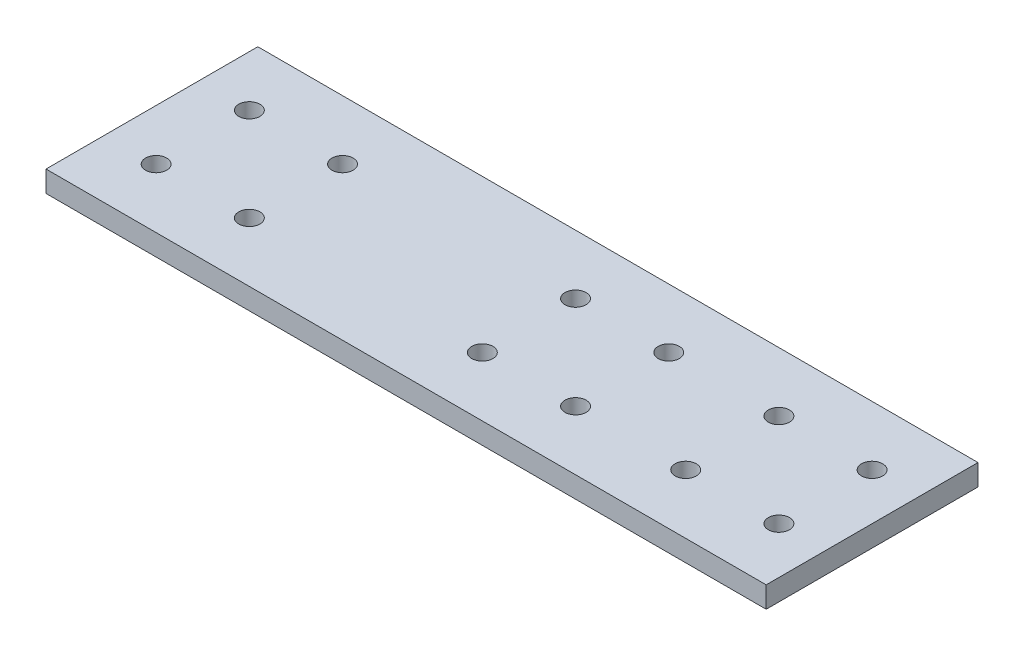
ISO-10303-21;
HEADER;
FILE_DESCRIPTION(('STEP AP214'),'2;1');
FILE_NAME('part.step','',(''),(''),'','','');
FILE_SCHEMA(('AUTOMOTIVE_DESIGN { 1 0 10303 214 1 1 1 1 }'));
ENDSEC;
DATA;
#1=APPLICATION_CONTEXT('core data for automotive mechanical design processes');
#2=APPLICATION_PROTOCOL_DEFINITION('international standard','automotive_design',2000,#1);
#3=PRODUCT_CONTEXT('',#1,'mechanical');
#4=PRODUCT('Part','Part','',(#3));
#5=PRODUCT_RELATED_PRODUCT_CATEGORY('part','',(#4));
#6=PRODUCT_DEFINITION_FORMATION('','',#4);
#7=PRODUCT_DEFINITION_CONTEXT('part definition',#1,'design');
#8=PRODUCT_DEFINITION('design','',#6,#7);
#9=PRODUCT_DEFINITION_SHAPE('','',#8);
#10=(LENGTH_UNIT() NAMED_UNIT(*) SI_UNIT(.MILLI.,.METRE.));
#11=(NAMED_UNIT(*) PLANE_ANGLE_UNIT() SI_UNIT($,.RADIAN.));
#12=(NAMED_UNIT(*) SI_UNIT($,.STERADIAN.) SOLID_ANGLE_UNIT());
#13=UNCERTAINTY_MEASURE_WITH_UNIT(LENGTH_MEASURE(1.E-05),#10,'distance_accuracy_value','');
#14=(GEOMETRIC_REPRESENTATION_CONTEXT(3) GLOBAL_UNCERTAINTY_ASSIGNED_CONTEXT((#13)) GLOBAL_UNIT_ASSIGNED_CONTEXT((#10,
#11,#12)) REPRESENTATION_CONTEXT('',''));
#15=CARTESIAN_POINT('',(0.,0.,0.));
#16=DIRECTION('',(0.,0.,1.));
#17=DIRECTION('',(1.,0.,0.));
#18=AXIS2_PLACEMENT_3D('',#15,#16,#17);
#19=CARTESIAN_POINT('',(0.,5.,0.));
#20=DIRECTION('',(0.,1.,0.));
#21=DIRECTION('',(0.,0.,1.));
#22=AXIS2_PLACEMENT_3D('',#19,#20,#21);
#23=PLANE('',#22);
#24=CARTESIAN_POINT('',(-51.,5.,11.));
#25=DIRECTION('',(0.,1.,0.));
#26=DIRECTION('',(0.,0.,-1.));
#27=AXIS2_PLACEMENT_3D('',#24,#25,#26);
#28=CIRCLE('',#27,2.5);
#29=CARTESIAN_POINT('',(-51.,5.,8.49999999999998));
#30=VERTEX_POINT('',#29);
#31=EDGE_CURVE('E171',#30,#30,#28,.T.);
#32=ORIENTED_EDGE('',*,*,#31,.F.);
#33=EDGE_LOOP('',(#32));
#34=FACE_BOUND('',#33,.T.);
#35=CARTESIAN_POINT('',(26.,5.,11.));
#36=DIRECTION('',(0.,1.,0.));
#37=DIRECTION('',(0.,0.,-1.));
#38=AXIS2_PLACEMENT_3D('',#35,#36,#37);
#39=CIRCLE('',#38,2.49999999999999);
#40=CARTESIAN_POINT('',(26.,5.,8.49999999999999));
#41=VERTEX_POINT('',#40);
#42=EDGE_CURVE('E159',#41,#41,#39,.T.);
#43=ORIENTED_EDGE('',*,*,#42,.F.);
#44=EDGE_LOOP('',(#43));
#45=FACE_BOUND('',#44,.T.);
#46=CARTESIAN_POINT('',(4.00000000000001,5.,-11.));
#47=DIRECTION('',(0.,1.,0.));
#48=DIRECTION('',(0.,0.,1.));
#49=AXIS2_PLACEMENT_3D('',#46,#47,#48);
#50=CIRCLE('',#49,2.5);
#51=CARTESIAN_POINT('',(4.00000000000001,5.,-8.50000000000001));
#52=VERTEX_POINT('',#51);
#53=EDGE_CURVE('E147',#52,#52,#50,.T.);
#54=ORIENTED_EDGE('',*,*,#53,.F.);
#55=EDGE_LOOP('',(#54));
#56=FACE_BOUND('',#55,.T.);
#57=CARTESIAN_POINT('',(26.,5.,-11.));
#58=DIRECTION('',(0.,1.,0.));
#59=DIRECTION('',(0.,0.,1.));
#60=AXIS2_PLACEMENT_3D('',#57,#58,#59);
#61=CIRCLE('',#60,2.49999999999999);
#62=CARTESIAN_POINT('',(26.,5.,-8.50000000000002));
#63=VERTEX_POINT('',#62);
#64=EDGE_CURVE('E135',#63,#63,#61,.T.);
#65=ORIENTED_EDGE('',*,*,#64,.F.);
#66=EDGE_LOOP('',(#65));
#67=FACE_BOUND('',#66,.T.);
#68=CARTESIAN_POINT('',(52.,5.,11.));
#69=DIRECTION('',(0.,1.,0.));
#70=DIRECTION('',(0.,0.,-1.));
#71=AXIS2_PLACEMENT_3D('',#68,#69,#70);
#72=CIRCLE('',#71,2.5);
#73=CARTESIAN_POINT('',(52.,5.,8.49999999999998));
#74=VERTEX_POINT('',#73);
#75=EDGE_CURVE('E123',#74,#74,#72,.T.);
#76=ORIENTED_EDGE('',*,*,#75,.F.);
#77=EDGE_LOOP('',(#76));
#78=FACE_BOUND('',#77,.T.);
#79=CARTESIAN_POINT('',(74.,5.,-11.));
#80=DIRECTION('',(0.,1.,0.));
#81=DIRECTION('',(0.,0.,1.));
#82=AXIS2_PLACEMENT_3D('',#79,#80,#81);
#83=CIRCLE('',#82,2.5);
#84=CARTESIAN_POINT('',(74.,5.,-8.50000000000002));
#85=VERTEX_POINT('',#84);
#86=EDGE_CURVE('E102',#85,#85,#83,.T.);
#87=ORIENTED_EDGE('',*,*,#86,.F.);
#88=EDGE_LOOP('',(#87));
#89=FACE_BOUND('',#88,.T.);
#90=DIRECTION('',(0.,0.,1.));
#91=VECTOR('',#90,1.);
#92=CARTESIAN_POINT('',(-85.,5.,-25.));
#93=LINE('',#92,#91);
#94=CARTESIAN_POINT('',(-85.,5.,-25.));
#95=VERTEX_POINT('',#94);
#96=CARTESIAN_POINT('',(-85.,5.,25.));
#97=VERTEX_POINT('',#96);
#98=EDGE_CURVE('E87',#95,#97,#93,.T.);
#99=ORIENTED_EDGE('',*,*,#98,.T.);
#100=DIRECTION('',(1.,0.,0.));
#101=VECTOR('',#100,1.);
#102=CARTESIAN_POINT('',(-85.,5.,25.));
#103=LINE('',#102,#101);
#104=CARTESIAN_POINT('',(85.,5.,25.));
#105=VERTEX_POINT('',#104);
#106=EDGE_CURVE('E82',#97,#105,#103,.T.);
#107=ORIENTED_EDGE('',*,*,#106,.T.);
#108=DIRECTION('',(0.,0.,-1.));
#109=VECTOR('',#108,1.);
#110=CARTESIAN_POINT('',(85.,5.,-25.));
#111=LINE('',#110,#109);
#112=CARTESIAN_POINT('',(85.,5.,-25.));
#113=VERTEX_POINT('',#112);
#114=EDGE_CURVE('E85',#105,#113,#111,.T.);
#115=ORIENTED_EDGE('',*,*,#114,.T.);
#116=DIRECTION('',(-1.,0.,0.));
#117=VECTOR('',#116,1.);
#118=CARTESIAN_POINT('',(-85.,5.,-25.));
#119=LINE('',#118,#117);
#120=EDGE_CURVE('E52',#113,#95,#119,.T.);
#121=ORIENTED_EDGE('',*,*,#120,.T.);
#122=EDGE_LOOP('',(#99,#107,#115,#121));
#123=FACE_BOUND('',#122,.T.);
#124=CARTESIAN_POINT('',(52.,5.,-11.));
#125=DIRECTION('',(0.,1.,0.));
#126=DIRECTION('',(0.,0.,1.));
#127=AXIS2_PLACEMENT_3D('',#124,#125,#126);
#128=CIRCLE('',#127,2.5);
#129=CARTESIAN_POINT('',(52.,5.,-8.50000000000002));
#130=VERTEX_POINT('',#129);
#131=EDGE_CURVE('E117',#130,#130,#128,.T.);
#132=ORIENTED_EDGE('',*,*,#131,.F.);
#133=EDGE_LOOP('',(#132));
#134=FACE_BOUND('',#133,.T.);
#135=CARTESIAN_POINT('',(74.,5.,11.));
#136=DIRECTION('',(0.,1.,0.));
#137=DIRECTION('',(0.,0.,-1.));
#138=AXIS2_PLACEMENT_3D('',#135,#136,#137);
#139=CIRCLE('',#138,2.5);
#140=CARTESIAN_POINT('',(74.,5.,8.49999999999999));
#141=VERTEX_POINT('',#140);
#142=EDGE_CURVE('E129',#141,#141,#139,.T.);
#143=ORIENTED_EDGE('',*,*,#142,.F.);
#144=EDGE_LOOP('',(#143));
#145=FACE_BOUND('',#144,.T.);
#146=CARTESIAN_POINT('',(-51.,5.,-11.));
#147=DIRECTION('',(0.,1.,0.));
#148=DIRECTION('',(0.,0.,1.));
#149=AXIS2_PLACEMENT_3D('',#146,#147,#148);
#150=CIRCLE('',#149,2.5);
#151=CARTESIAN_POINT('',(-51.,5.,-8.50000000000002));
#152=VERTEX_POINT('',#151);
#153=EDGE_CURVE('E141',#152,#152,#150,.T.);
#154=ORIENTED_EDGE('',*,*,#153,.F.);
#155=EDGE_LOOP('',(#154));
#156=FACE_BOUND('',#155,.T.);
#157=CARTESIAN_POINT('',(4.00000000000001,5.,11.));
#158=DIRECTION('',(0.,1.,0.));
#159=DIRECTION('',(0.,0.,-1.));
#160=AXIS2_PLACEMENT_3D('',#157,#158,#159);
#161=CIRCLE('',#160,2.5);
#162=CARTESIAN_POINT('',(4.00000000000001,5.,8.49999999999998));
#163=VERTEX_POINT('',#162);
#164=EDGE_CURVE('E153',#163,#163,#161,.T.);
#165=ORIENTED_EDGE('',*,*,#164,.F.);
#166=EDGE_LOOP('',(#165));
#167=FACE_BOUND('',#166,.T.);
#168=CARTESIAN_POINT('',(-73.,5.,-11.));
#169=DIRECTION('',(0.,1.,0.));
#170=DIRECTION('',(0.,0.,1.));
#171=AXIS2_PLACEMENT_3D('',#168,#169,#170);
#172=CIRCLE('',#171,2.49999999999999);
#173=CARTESIAN_POINT('',(-73.,5.,-8.50000000000002));
#174=VERTEX_POINT('',#173);
#175=EDGE_CURVE('E165',#174,#174,#172,.T.);
#176=ORIENTED_EDGE('',*,*,#175,.F.);
#177=EDGE_LOOP('',(#176));
#178=FACE_BOUND('',#177,.T.);
#179=CARTESIAN_POINT('',(-73.,5.,11.));
#180=DIRECTION('',(0.,1.,0.));
#181=DIRECTION('',(0.,0.,-1.));
#182=AXIS2_PLACEMENT_3D('',#179,#180,#181);
#183=CIRCLE('',#182,2.49999999999999);
#184=CARTESIAN_POINT('',(-73.,5.,8.49999999999999));
#185=VERTEX_POINT('',#184);
#186=EDGE_CURVE('E177',#185,#185,#183,.T.);
#187=ORIENTED_EDGE('',*,*,#186,.F.);
#188=EDGE_LOOP('',(#187));
#189=FACE_BOUND('',#188,.T.);
#190=ADVANCED_FACE('F35',(#34,#45,#56,#67,#78,#89,#123,#134,#145,#156,#167,#178,#189),#23,.T.);
#191=CARTESIAN_POINT('',(0.,0.,0.));
#192=DIRECTION('',(0.,1.,0.));
#193=DIRECTION('',(0.,0.,1.));
#194=AXIS2_PLACEMENT_3D('',#191,#192,#193);
#195=PLANE('',#194);
#196=DIRECTION('',(0.,0.,1.));
#197=VECTOR('',#196,1.);
#198=CARTESIAN_POINT('',(-85.,0.,-25.));
#199=LINE('',#198,#197);
#200=CARTESIAN_POINT('',(-85.,0.,-25.));
#201=VERTEX_POINT('',#200);
#202=CARTESIAN_POINT('',(-85.,0.,25.));
#203=VERTEX_POINT('',#202);
#204=EDGE_CURVE('E99',#201,#203,#199,.T.);
#205=ORIENTED_EDGE('',*,*,#204,.F.);
#206=DIRECTION('',(-1.,0.,0.));
#207=VECTOR('',#206,1.);
#208=CARTESIAN_POINT('',(-85.,0.,-25.));
#209=LINE('',#208,#207);
#210=CARTESIAN_POINT('',(85.,0.,-25.));
#211=VERTEX_POINT('',#210);
#212=EDGE_CURVE('E75',#211,#201,#209,.T.);
#213=ORIENTED_EDGE('',*,*,#212,.F.);
#214=DIRECTION('',(0.,0.,-1.));
#215=VECTOR('',#214,1.);
#216=CARTESIAN_POINT('',(85.,0.,-25.));
#217=LINE('',#216,#215);
#218=CARTESIAN_POINT('',(85.,0.,25.));
#219=VERTEX_POINT('',#218);
#220=EDGE_CURVE('E69',#219,#211,#217,.T.);
#221=ORIENTED_EDGE('',*,*,#220,.F.);
#222=DIRECTION('',(1.,0.,0.));
#223=VECTOR('',#222,1.);
#224=CARTESIAN_POINT('',(-85.,0.,25.));
#225=LINE('',#224,#223);
#226=EDGE_CURVE('E91',#203,#219,#225,.T.);
#227=ORIENTED_EDGE('',*,*,#226,.F.);
#228=EDGE_LOOP('',(#205,#213,#221,#227));
#229=FACE_BOUND('',#228,.T.);
#230=CARTESIAN_POINT('',(74.,0.,-11.));
#231=DIRECTION('',(0.,1.,0.));
#232=DIRECTION('',(0.,0.,1.));
#233=AXIS2_PLACEMENT_3D('',#230,#231,#232);
#234=CIRCLE('',#233,2.5);
#235=CARTESIAN_POINT('',(74.,0.,-8.50000000000002));
#236=VERTEX_POINT('',#235);
#237=EDGE_CURVE('E114',#236,#236,#234,.T.);
#238=ORIENTED_EDGE('',*,*,#237,.T.);
#239=EDGE_LOOP('',(#238));
#240=FACE_BOUND('',#239,.T.);
#241=CARTESIAN_POINT('',(52.,0.,-11.));
#242=DIRECTION('',(0.,1.,0.));
#243=DIRECTION('',(0.,0.,1.));
#244=AXIS2_PLACEMENT_3D('',#241,#242,#243);
#245=CIRCLE('',#244,2.5);
#246=CARTESIAN_POINT('',(52.,0.,-8.50000000000002));
#247=VERTEX_POINT('',#246);
#248=EDGE_CURVE('E120',#247,#247,#245,.T.);
#249=ORIENTED_EDGE('',*,*,#248,.T.);
#250=EDGE_LOOP('',(#249));
#251=FACE_BOUND('',#250,.T.);
#252=CARTESIAN_POINT('',(52.,0.,11.));
#253=DIRECTION('',(0.,1.,0.));
#254=DIRECTION('',(0.,0.,-1.));
#255=AXIS2_PLACEMENT_3D('',#252,#253,#254);
#256=CIRCLE('',#255,2.5);
#257=CARTESIAN_POINT('',(52.,0.,8.49999999999998));
#258=VERTEX_POINT('',#257);
#259=EDGE_CURVE('E126',#258,#258,#256,.T.);
#260=ORIENTED_EDGE('',*,*,#259,.T.);
#261=EDGE_LOOP('',(#260));
#262=FACE_BOUND('',#261,.T.);
#263=CARTESIAN_POINT('',(74.,0.,11.));
#264=DIRECTION('',(0.,1.,0.));
#265=DIRECTION('',(0.,0.,-1.));
#266=AXIS2_PLACEMENT_3D('',#263,#264,#265);
#267=CIRCLE('',#266,2.5);
#268=CARTESIAN_POINT('',(74.,0.,8.49999999999999));
#269=VERTEX_POINT('',#268);
#270=EDGE_CURVE('E132',#269,#269,#267,.T.);
#271=ORIENTED_EDGE('',*,*,#270,.T.);
#272=EDGE_LOOP('',(#271));
#273=FACE_BOUND('',#272,.T.);
#274=CARTESIAN_POINT('',(26.,0.,-11.));
#275=DIRECTION('',(0.,1.,0.));
#276=DIRECTION('',(0.,0.,1.));
#277=AXIS2_PLACEMENT_3D('',#274,#275,#276);
#278=CIRCLE('',#277,2.49999999999999);
#279=CARTESIAN_POINT('',(26.,0.,-8.50000000000002));
#280=VERTEX_POINT('',#279);
#281=EDGE_CURVE('E138',#280,#280,#278,.T.);
#282=ORIENTED_EDGE('',*,*,#281,.T.);
#283=EDGE_LOOP('',(#282));
#284=FACE_BOUND('',#283,.T.);
#285=CARTESIAN_POINT('',(-51.,0.,-11.));
#286=DIRECTION('',(0.,1.,0.));
#287=DIRECTION('',(0.,0.,1.));
#288=AXIS2_PLACEMENT_3D('',#285,#286,#287);
#289=CIRCLE('',#288,2.5);
#290=CARTESIAN_POINT('',(-51.,0.,-8.50000000000002));
#291=VERTEX_POINT('',#290);
#292=EDGE_CURVE('E144',#291,#291,#289,.T.);
#293=ORIENTED_EDGE('',*,*,#292,.T.);
#294=EDGE_LOOP('',(#293));
#295=FACE_BOUND('',#294,.T.);
#296=CARTESIAN_POINT('',(4.00000000000001,0.,-11.));
#297=DIRECTION('',(0.,1.,0.));
#298=DIRECTION('',(0.,0.,1.));
#299=AXIS2_PLACEMENT_3D('',#296,#297,#298);
#300=CIRCLE('',#299,2.5);
#301=CARTESIAN_POINT('',(4.00000000000001,0.,-8.50000000000001));
#302=VERTEX_POINT('',#301);
#303=EDGE_CURVE('E150',#302,#302,#300,.T.);
#304=ORIENTED_EDGE('',*,*,#303,.T.);
#305=EDGE_LOOP('',(#304));
#306=FACE_BOUND('',#305,.T.);
#307=CARTESIAN_POINT('',(4.00000000000001,0.,11.));
#308=DIRECTION('',(0.,1.,0.));
#309=DIRECTION('',(0.,0.,-1.));
#310=AXIS2_PLACEMENT_3D('',#307,#308,#309);
#311=CIRCLE('',#310,2.5);
#312=CARTESIAN_POINT('',(4.00000000000001,0.,8.49999999999998));
#313=VERTEX_POINT('',#312);
#314=EDGE_CURVE('E156',#313,#313,#311,.T.);
#315=ORIENTED_EDGE('',*,*,#314,.T.);
#316=EDGE_LOOP('',(#315));
#317=FACE_BOUND('',#316,.T.);
#318=CARTESIAN_POINT('',(26.,0.,11.));
#319=DIRECTION('',(0.,1.,0.));
#320=DIRECTION('',(0.,0.,-1.));
#321=AXIS2_PLACEMENT_3D('',#318,#319,#320);
#322=CIRCLE('',#321,2.49999999999999);
#323=CARTESIAN_POINT('',(26.,0.,8.49999999999999));
#324=VERTEX_POINT('',#323);
#325=EDGE_CURVE('E162',#324,#324,#322,.T.);
#326=ORIENTED_EDGE('',*,*,#325,.T.);
#327=EDGE_LOOP('',(#326));
#328=FACE_BOUND('',#327,.T.);
#329=CARTESIAN_POINT('',(-73.,0.,-11.));
#330=DIRECTION('',(0.,1.,0.));
#331=DIRECTION('',(0.,0.,1.));
#332=AXIS2_PLACEMENT_3D('',#329,#330,#331);
#333=CIRCLE('',#332,2.49999999999999);
#334=CARTESIAN_POINT('',(-73.,0.,-8.50000000000002));
#335=VERTEX_POINT('',#334);
#336=EDGE_CURVE('E168',#335,#335,#333,.T.);
#337=ORIENTED_EDGE('',*,*,#336,.T.);
#338=EDGE_LOOP('',(#337));
#339=FACE_BOUND('',#338,.T.);
#340=CARTESIAN_POINT('',(-51.,0.,11.));
#341=DIRECTION('',(0.,1.,0.));
#342=DIRECTION('',(0.,0.,-1.));
#343=AXIS2_PLACEMENT_3D('',#340,#341,#342);
#344=CIRCLE('',#343,2.5);
#345=CARTESIAN_POINT('',(-51.,0.,8.49999999999998));
#346=VERTEX_POINT('',#345);
#347=EDGE_CURVE('E174',#346,#346,#344,.T.);
#348=ORIENTED_EDGE('',*,*,#347,.T.);
#349=EDGE_LOOP('',(#348));
#350=FACE_BOUND('',#349,.T.);
#351=CARTESIAN_POINT('',(-73.,0.,11.));
#352=DIRECTION('',(0.,1.,0.));
#353=DIRECTION('',(0.,0.,-1.));
#354=AXIS2_PLACEMENT_3D('',#351,#352,#353);
#355=CIRCLE('',#354,2.49999999999999);
#356=CARTESIAN_POINT('',(-73.,0.,8.49999999999999));
#357=VERTEX_POINT('',#356);
#358=EDGE_CURVE('E180',#357,#357,#355,.T.);
#359=ORIENTED_EDGE('',*,*,#358,.T.);
#360=EDGE_LOOP('',(#359));
#361=FACE_BOUND('',#360,.T.);
#362=ADVANCED_FACE('F110',(#229,#240,#251,#262,#273,#284,#295,#306,#317,#328,#339,#350,#361),
#195,.F.);
#363=CARTESIAN_POINT('',(-85.,5.,-25.));
#364=DIRECTION('',(1.,0.,0.));
#365=DIRECTION('',(0.,0.,-1.));
#366=AXIS2_PLACEMENT_3D('',#363,#364,#365);
#367=PLANE('',#366);
#368=ORIENTED_EDGE('',*,*,#204,.T.);
#369=DIRECTION('',(0.,-1.,0.));
#370=VECTOR('',#369,1.);
#371=CARTESIAN_POINT('',(-85.,5.,25.));
#372=LINE('',#371,#370);
#373=EDGE_CURVE('E11',#97,#203,#372,.T.);
#374=ORIENTED_EDGE('',*,*,#373,.F.);
#375=ORIENTED_EDGE('',*,*,#98,.F.);
#376=DIRECTION('',(0.,-1.,0.));
#377=VECTOR('',#376,1.);
#378=CARTESIAN_POINT('',(-85.,5.,-25.));
#379=LINE('',#378,#377);
#380=EDGE_CURVE('E95',#95,#201,#379,.T.);
#381=ORIENTED_EDGE('',*,*,#380,.T.);
#382=EDGE_LOOP('',(#368,#374,#375,#381));
#383=FACE_BOUND('',#382,.T.);
#384=ADVANCED_FACE('F37',(#383),#367,.F.);
#385=CARTESIAN_POINT('',(-85.,5.,25.));
#386=DIRECTION('',(0.,0.,-1.));
#387=DIRECTION('',(-1.,0.,0.));
#388=AXIS2_PLACEMENT_3D('',#385,#386,#387);
#389=PLANE('',#388);
#390=ORIENTED_EDGE('',*,*,#226,.T.);
#391=DIRECTION('',(0.,-1.,0.));
#392=VECTOR('',#391,1.);
#393=CARTESIAN_POINT('',(85.,5.,25.));
#394=LINE('',#393,#392);
#395=EDGE_CURVE('E44',#105,#219,#394,.T.);
#396=ORIENTED_EDGE('',*,*,#395,.F.);
#397=ORIENTED_EDGE('',*,*,#106,.F.);
#398=ORIENTED_EDGE('',*,*,#373,.T.);
#399=EDGE_LOOP('',(#390,#396,#397,#398));
#400=FACE_BOUND('',#399,.T.);
#401=ADVANCED_FACE('F90',(#400),#389,.F.);
#402=CARTESIAN_POINT('',(85.,5.,-25.));
#403=DIRECTION('',(-1.,0.,0.));
#404=DIRECTION('',(0.,0.,1.));
#405=AXIS2_PLACEMENT_3D('',#402,#403,#404);
#406=PLANE('',#405);
#407=ORIENTED_EDGE('',*,*,#220,.T.);
#408=DIRECTION('',(0.,-1.,0.));
#409=VECTOR('',#408,1.);
#410=CARTESIAN_POINT('',(85.,5.,-25.));
#411=LINE('',#410,#409);
#412=EDGE_CURVE('E92',#113,#211,#411,.T.);
#413=ORIENTED_EDGE('',*,*,#412,.F.);
#414=ORIENTED_EDGE('',*,*,#114,.F.);
#415=ORIENTED_EDGE('',*,*,#395,.T.);
#416=EDGE_LOOP('',(#407,#413,#414,#415));
#417=FACE_BOUND('',#416,.T.);
#418=ADVANCED_FACE('F93',(#417),#406,.F.);
#419=CARTESIAN_POINT('',(-85.,5.,-25.));
#420=DIRECTION('',(0.,0.,1.));
#421=DIRECTION('',(1.,0.,0.));
#422=AXIS2_PLACEMENT_3D('',#419,#420,#421);
#423=PLANE('',#422);
#424=ORIENTED_EDGE('',*,*,#212,.T.);
#425=ORIENTED_EDGE('',*,*,#380,.F.);
#426=ORIENTED_EDGE('',*,*,#120,.F.);
#427=ORIENTED_EDGE('',*,*,#412,.T.);
#428=EDGE_LOOP('',(#424,#425,#426,#427));
#429=FACE_BOUND('',#428,.T.);
#430=ADVANCED_FACE('F107',(#429),#423,.F.);
#431=CARTESIAN_POINT('',(74.,5.,-11.));
#432=DIRECTION('',(0.,-1.,0.));
#433=DIRECTION('',(0.,0.,-1.));
#434=AXIS2_PLACEMENT_3D('',#431,#432,#433);
#435=CYLINDRICAL_SURFACE('',#434,2.5);
#436=ORIENTED_EDGE('',*,*,#86,.T.);
#437=EDGE_LOOP('',(#436));
#438=FACE_BOUND('',#437,.T.);
#439=ORIENTED_EDGE('',*,*,#237,.F.);
#440=EDGE_LOOP('',(#439));
#441=FACE_BOUND('',#440,.T.);
#442=ADVANCED_FACE('F199',(#438,#441),#435,.F.);
#443=CARTESIAN_POINT('',(52.,5.,-11.));
#444=DIRECTION('',(0.,-1.,0.));
#445=DIRECTION('',(0.,0.,-1.));
#446=AXIS2_PLACEMENT_3D('',#443,#444,#445);
#447=CYLINDRICAL_SURFACE('',#446,2.5);
#448=ORIENTED_EDGE('',*,*,#131,.T.);
#449=EDGE_LOOP('',(#448));
#450=FACE_BOUND('',#449,.T.);
#451=ORIENTED_EDGE('',*,*,#248,.F.);
#452=EDGE_LOOP('',(#451));
#453=FACE_BOUND('',#452,.T.);
#454=ADVANCED_FACE('F245',(#450,#453),#447,.F.);
#455=CARTESIAN_POINT('',(52.,5.,11.));
#456=DIRECTION('',(0.,-1.,0.));
#457=DIRECTION('',(0.,0.,-1.));
#458=AXIS2_PLACEMENT_3D('',#455,#456,#457);
#459=CYLINDRICAL_SURFACE('',#458,2.5);
#460=ORIENTED_EDGE('',*,*,#75,.T.);
#461=EDGE_LOOP('',(#460));
#462=FACE_BOUND('',#461,.T.);
#463=ORIENTED_EDGE('',*,*,#259,.F.);
#464=EDGE_LOOP('',(#463));
#465=FACE_BOUND('',#464,.T.);
#466=ADVANCED_FACE('F253',(#462,#465),#459,.F.);
#467=CARTESIAN_POINT('',(74.,5.,11.));
#468=DIRECTION('',(0.,-1.,0.));
#469=DIRECTION('',(0.,0.,-1.));
#470=AXIS2_PLACEMENT_3D('',#467,#468,#469);
#471=CYLINDRICAL_SURFACE('',#470,2.5);
#472=ORIENTED_EDGE('',*,*,#142,.T.);
#473=EDGE_LOOP('',(#472));
#474=FACE_BOUND('',#473,.T.);
#475=ORIENTED_EDGE('',*,*,#270,.F.);
#476=EDGE_LOOP('',(#475));
#477=FACE_BOUND('',#476,.T.);
#478=ADVANCED_FACE('F261',(#474,#477),#471,.F.);
#479=CARTESIAN_POINT('',(26.,5.,-11.));
#480=DIRECTION('',(0.,-1.,0.));
#481=DIRECTION('',(0.,0.,-1.));
#482=AXIS2_PLACEMENT_3D('',#479,#480,#481);
#483=CYLINDRICAL_SURFACE('',#482,2.49999999999999);
#484=ORIENTED_EDGE('',*,*,#64,.T.);
#485=EDGE_LOOP('',(#484));
#486=FACE_BOUND('',#485,.T.);
#487=ORIENTED_EDGE('',*,*,#281,.F.);
#488=EDGE_LOOP('',(#487));
#489=FACE_BOUND('',#488,.T.);
#490=ADVANCED_FACE('F270',(#486,#489),#483,.F.);
#491=CARTESIAN_POINT('',(-51.,5.,-11.));
#492=DIRECTION('',(0.,-1.,0.));
#493=DIRECTION('',(0.,0.,-1.));
#494=AXIS2_PLACEMENT_3D('',#491,#492,#493);
#495=CYLINDRICAL_SURFACE('',#494,2.5);
#496=ORIENTED_EDGE('',*,*,#153,.T.);
#497=EDGE_LOOP('',(#496));
#498=FACE_BOUND('',#497,.T.);
#499=ORIENTED_EDGE('',*,*,#292,.F.);
#500=EDGE_LOOP('',(#499));
#501=FACE_BOUND('',#500,.T.);
#502=ADVANCED_FACE('F279',(#498,#501),#495,.F.);
#503=CARTESIAN_POINT('',(4.00000000000001,5.,-11.));
#504=DIRECTION('',(0.,-1.,0.));
#505=DIRECTION('',(0.,0.,-1.));
#506=AXIS2_PLACEMENT_3D('',#503,#504,#505);
#507=CYLINDRICAL_SURFACE('',#506,2.5);
#508=ORIENTED_EDGE('',*,*,#53,.T.);
#509=EDGE_LOOP('',(#508));
#510=FACE_BOUND('',#509,.T.);
#511=ORIENTED_EDGE('',*,*,#303,.F.);
#512=EDGE_LOOP('',(#511));
#513=FACE_BOUND('',#512,.T.);
#514=ADVANCED_FACE('F288',(#510,#513),#507,.F.);
#515=CARTESIAN_POINT('',(4.00000000000001,5.,11.));
#516=DIRECTION('',(0.,-1.,0.));
#517=DIRECTION('',(0.,0.,-1.));
#518=AXIS2_PLACEMENT_3D('',#515,#516,#517);
#519=CYLINDRICAL_SURFACE('',#518,2.5);
#520=ORIENTED_EDGE('',*,*,#164,.T.);
#521=EDGE_LOOP('',(#520));
#522=FACE_BOUND('',#521,.T.);
#523=ORIENTED_EDGE('',*,*,#314,.F.);
#524=EDGE_LOOP('',(#523));
#525=FACE_BOUND('',#524,.T.);
#526=ADVANCED_FACE('F297',(#522,#525),#519,.F.);
#527=CARTESIAN_POINT('',(26.,5.,11.));
#528=DIRECTION('',(0.,-1.,0.));
#529=DIRECTION('',(0.,0.,-1.));
#530=AXIS2_PLACEMENT_3D('',#527,#528,#529);
#531=CYLINDRICAL_SURFACE('',#530,2.49999999999999);
#532=ORIENTED_EDGE('',*,*,#42,.T.);
#533=EDGE_LOOP('',(#532));
#534=FACE_BOUND('',#533,.T.);
#535=ORIENTED_EDGE('',*,*,#325,.F.);
#536=EDGE_LOOP('',(#535));
#537=FACE_BOUND('',#536,.T.);
#538=ADVANCED_FACE('F306',(#534,#537),#531,.F.);
#539=CARTESIAN_POINT('',(-73.,5.,-11.));
#540=DIRECTION('',(0.,-1.,0.));
#541=DIRECTION('',(0.,0.,-1.));
#542=AXIS2_PLACEMENT_3D('',#539,#540,#541);
#543=CYLINDRICAL_SURFACE('',#542,2.49999999999999);
#544=ORIENTED_EDGE('',*,*,#175,.T.);
#545=EDGE_LOOP('',(#544));
#546=FACE_BOUND('',#545,.T.);
#547=ORIENTED_EDGE('',*,*,#336,.F.);
#548=EDGE_LOOP('',(#547));
#549=FACE_BOUND('',#548,.T.);
#550=ADVANCED_FACE('F315',(#546,#549),#543,.F.);
#551=CARTESIAN_POINT('',(-51.,5.,11.));
#552=DIRECTION('',(0.,-1.,0.));
#553=DIRECTION('',(0.,0.,-1.));
#554=AXIS2_PLACEMENT_3D('',#551,#552,#553);
#555=CYLINDRICAL_SURFACE('',#554,2.5);
#556=ORIENTED_EDGE('',*,*,#31,.T.);
#557=EDGE_LOOP('',(#556));
#558=FACE_BOUND('',#557,.T.);
#559=ORIENTED_EDGE('',*,*,#347,.F.);
#560=EDGE_LOOP('',(#559));
#561=FACE_BOUND('',#560,.T.);
#562=ADVANCED_FACE('F324',(#558,#561),#555,.F.);
#563=CARTESIAN_POINT('',(-73.,5.,11.));
#564=DIRECTION('',(0.,-1.,0.));
#565=DIRECTION('',(0.,0.,-1.));
#566=AXIS2_PLACEMENT_3D('',#563,#564,#565);
#567=CYLINDRICAL_SURFACE('',#566,2.49999999999999);
#568=ORIENTED_EDGE('',*,*,#186,.T.);
#569=EDGE_LOOP('',(#568));
#570=FACE_BOUND('',#569,.T.);
#571=ORIENTED_EDGE('',*,*,#358,.F.);
#572=EDGE_LOOP('',(#571));
#573=FACE_BOUND('',#572,.T.);
#574=ADVANCED_FACE('F186',(#570,#573),#567,.F.);
#575=CLOSED_SHELL('',(#190,#362,#384,#401,#418,#430,#442,#454,#466,#478,#490,#502,#514,#526,
#538,#550,#562,#574));
#576=MANIFOLD_SOLID_BREP('B2',#575);
#577=ADVANCED_BREP_SHAPE_REPRESENTATION('',(#18,#576),#14);
#578=SHAPE_DEFINITION_REPRESENTATION(#9,#577);
ENDSEC;
END-ISO-10303-21;
